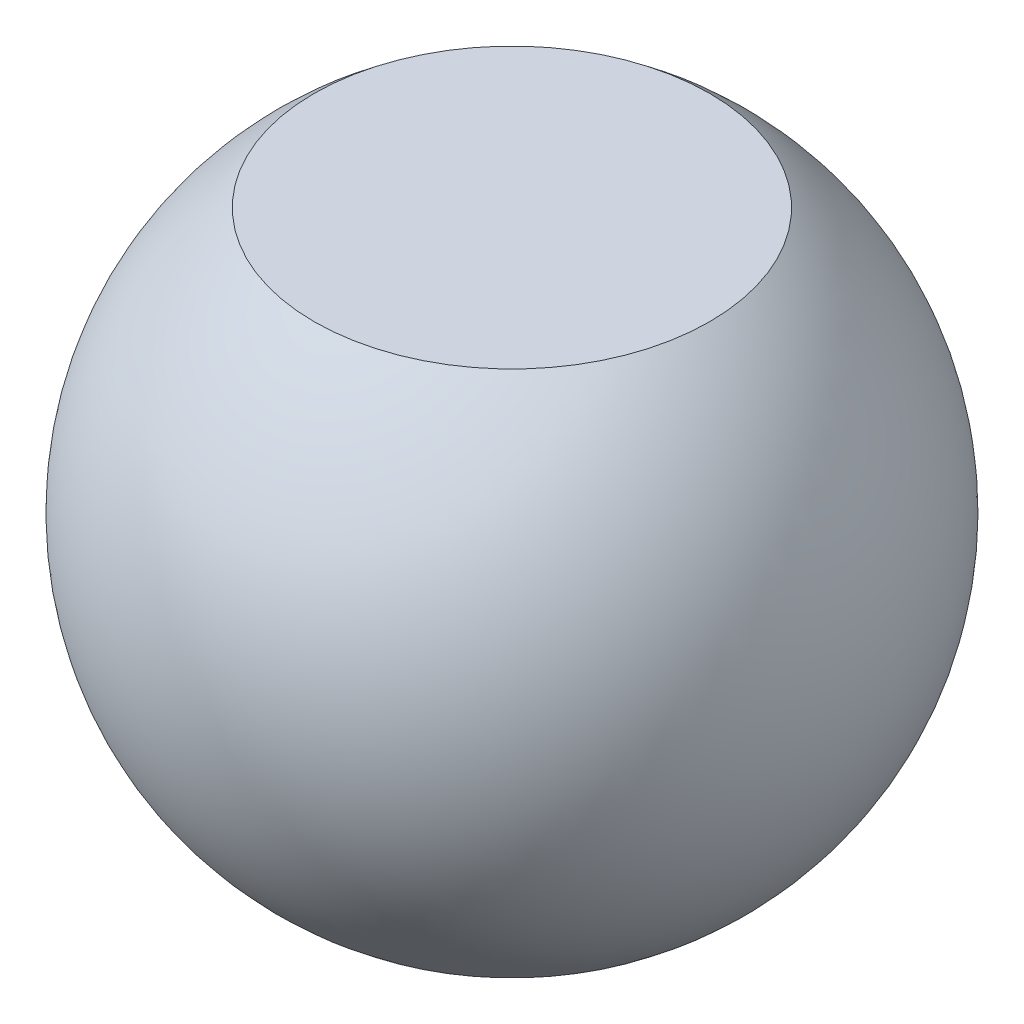
ISO-10303-21;
HEADER;
FILE_DESCRIPTION(('STEP AP214'),'2;1');
FILE_NAME('part.step','',(''),(''),'','','');
FILE_SCHEMA(('AUTOMOTIVE_DESIGN { 1 0 10303 214 1 1 1 1 }'));
ENDSEC;
DATA;
#1=APPLICATION_CONTEXT('core data for automotive mechanical design processes');
#2=APPLICATION_PROTOCOL_DEFINITION('international standard','automotive_design',2000,#1);
#3=PRODUCT_CONTEXT('',#1,'mechanical');
#4=PRODUCT('Part','Part','',(#3));
#5=PRODUCT_RELATED_PRODUCT_CATEGORY('part','',(#4));
#6=PRODUCT_DEFINITION_FORMATION('','',#4);
#7=PRODUCT_DEFINITION_CONTEXT('part definition',#1,'design');
#8=PRODUCT_DEFINITION('design','',#6,#7);
#9=PRODUCT_DEFINITION_SHAPE('','',#8);
#10=(LENGTH_UNIT() NAMED_UNIT(*) SI_UNIT(.MILLI.,.METRE.));
#11=(NAMED_UNIT(*) PLANE_ANGLE_UNIT() SI_UNIT($,.RADIAN.));
#12=(NAMED_UNIT(*) SI_UNIT($,.STERADIAN.) SOLID_ANGLE_UNIT());
#13=UNCERTAINTY_MEASURE_WITH_UNIT(LENGTH_MEASURE(1.E-05),#10,'distance_accuracy_value','');
#14=(GEOMETRIC_REPRESENTATION_CONTEXT(3) GLOBAL_UNCERTAINTY_ASSIGNED_CONTEXT((#13)) GLOBAL_UNIT_ASSIGNED_CONTEXT((#10,
#11,#12)) REPRESENTATION_CONTEXT('',''));
#15=CARTESIAN_POINT('',(0.,0.,0.));
#16=DIRECTION('',(0.,0.,1.));
#17=DIRECTION('',(1.,0.,0.));
#18=AXIS2_PLACEMENT_3D('',#15,#16,#17);
#19=CARTESIAN_POINT('',(0.,0.3,0.));
#20=DIRECTION('',(0.,-1.,0.));
#21=DIRECTION('',(1.,0.,0.));
#22=AXIS2_PLACEMENT_3D('',#19,#20,#21);
#23=PLANE('',#22);
#24=CARTESIAN_POINT('',(0.,0.3,0.));
#25=DIRECTION('',(0.,1.,0.));
#26=DIRECTION('',(-1.,0.,0.));
#27=AXIS2_PLACEMENT_3D('',#24,#25,#26);
#28=CIRCLE('',#27,0.225);
#29=CARTESIAN_POINT('',(-0.225,0.3,0.));
#30=VERTEX_POINT('',#29);
#31=EDGE_CURVE('E41',#30,#30,#28,.T.);
#32=ORIENTED_EDGE('',*,*,#31,.T.);
#33=EDGE_LOOP('',(#32));
#34=FACE_BOUND('',#33,.T.);
#35=ADVANCED_FACE('F35',(#34),#23,.F.);
#36=CARTESIAN_POINT('',(0.,-0.3,0.));
#37=DIRECTION('',(0.,1.,0.));
#38=DIRECTION('',(-1.,0.,0.));
#39=AXIS2_PLACEMENT_3D('',#36,#37,#38);
#40=PLANE('',#39);
#41=CARTESIAN_POINT('',(0.,-0.3,0.));
#42=DIRECTION('',(0.,1.,0.));
#43=DIRECTION('',(-1.,0.,0.));
#44=AXIS2_PLACEMENT_3D('',#41,#42,#43);
#45=CIRCLE('',#44,0.225);
#46=CARTESIAN_POINT('',(-0.225,-0.3,0.));
#47=VERTEX_POINT('',#46);
#48=EDGE_CURVE('E10',#47,#47,#45,.T.);
#49=ORIENTED_EDGE('',*,*,#48,.F.);
#50=EDGE_LOOP('',(#49));
#51=FACE_BOUND('',#50,.T.);
#52=ADVANCED_FACE('F50',(#51),#40,.F.);
#53=CARTESIAN_POINT('',(0.,0.,0.));
#54=DIRECTION('',(0.,1.,0.));
#55=DIRECTION('',(1.,0.,0.));
#56=AXIS2_PLACEMENT_3D('',#53,#54,#55);
#57=SPHERICAL_SURFACE('',#56,0.375);
#58=ORIENTED_EDGE('',*,*,#31,.F.);
#59=EDGE_LOOP('',(#58));
#60=FACE_BOUND('',#59,.T.);
#61=ORIENTED_EDGE('',*,*,#48,.T.);
#62=EDGE_LOOP('',(#61));
#63=FACE_BOUND('',#62,.T.);
#64=ADVANCED_FACE('F48',(#60,#63),#57,.T.);
#65=CLOSED_SHELL('',(#35,#52,#64));
#66=MANIFOLD_SOLID_BREP('B2',#65);
#67=ADVANCED_BREP_SHAPE_REPRESENTATION('',(#18,#66),#14);
#68=SHAPE_DEFINITION_REPRESENTATION(#9,#67);
ENDSEC;
END-ISO-10303-21;
